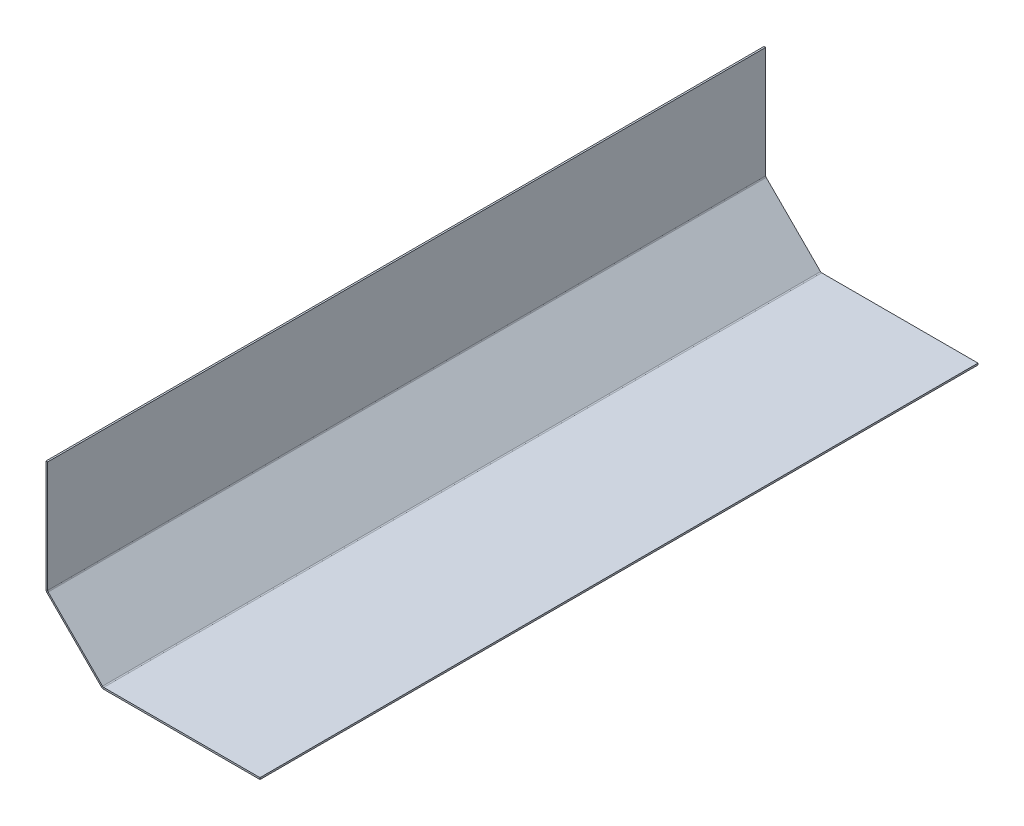
ISO-10303-21;
HEADER;
FILE_DESCRIPTION(('STEP AP214'),'2;1');
FILE_NAME('part.step','',(''),(''),'','','');
FILE_SCHEMA(('AUTOMOTIVE_DESIGN { 1 0 10303 214 1 1 1 1 }'));
ENDSEC;
DATA;
#1=APPLICATION_CONTEXT('core data for automotive mechanical design processes');
#2=APPLICATION_PROTOCOL_DEFINITION('international standard','automotive_design',2000,#1);
#3=PRODUCT_CONTEXT('',#1,'mechanical');
#4=PRODUCT('Part','Part','',(#3));
#5=PRODUCT_RELATED_PRODUCT_CATEGORY('part','',(#4));
#6=PRODUCT_DEFINITION_FORMATION('','',#4);
#7=PRODUCT_DEFINITION_CONTEXT('part definition',#1,'design');
#8=PRODUCT_DEFINITION('design','',#6,#7);
#9=PRODUCT_DEFINITION_SHAPE('','',#8);
#10=(LENGTH_UNIT() NAMED_UNIT(*) SI_UNIT(.MILLI.,.METRE.));
#11=(NAMED_UNIT(*) PLANE_ANGLE_UNIT() SI_UNIT($,.RADIAN.));
#12=(NAMED_UNIT(*) SI_UNIT($,.STERADIAN.) SOLID_ANGLE_UNIT());
#13=UNCERTAINTY_MEASURE_WITH_UNIT(LENGTH_MEASURE(1.E-05),#10,'distance_accuracy_value','');
#14=(GEOMETRIC_REPRESENTATION_CONTEXT(3) GLOBAL_UNCERTAINTY_ASSIGNED_CONTEXT((#13)) GLOBAL_UNIT_ASSIGNED_CONTEXT((#10,
#11,#12)) REPRESENTATION_CONTEXT('',''));
#15=CARTESIAN_POINT('',(0.,0.,0.));
#16=DIRECTION('',(0.,0.,1.));
#17=DIRECTION('',(1.,0.,0.));
#18=AXIS2_PLACEMENT_3D('',#15,#16,#17);
#19=CARTESIAN_POINT('',(3.51471862576144,-403.514718625761,-2550.));
#20=DIRECTION('',(0.,0.,-1.));
#21=DIRECTION('',(-1.,0.,0.));
#22=AXIS2_PLACEMENT_3D('',#19,#20,#21);
#23=PLANE('',#22);
#24=DIRECTION('',(0.70710678118655,0.707106781186545,0.));
#25=VECTOR('',#24,1.);
#26=CARTESIAN_POINT('',(3.51471862576144,-403.514718625761,-2550.));
#27=LINE('',#26,#25);
#28=CARTESIAN_POINT('',(3.51471862576144,-403.514718625761,-2550.));
#29=VERTEX_POINT('',#28);
#30=CARTESIAN_POINT('',(7.75735931288074,-399.272077938642,-2550.));
#31=VERTEX_POINT('',#30);
#32=EDGE_CURVE('E11',#29,#31,#27,.T.);
#33=ORIENTED_EDGE('',*,*,#32,.F.);
#34=CARTESIAN_POINT('',(12.,-395.029437251523,-2550.));
#35=DIRECTION('',(0.,0.,-1.));
#36=DIRECTION('',(-1.,0.,0.));
#37=AXIS2_PLACEMENT_3D('',#34,#35,#36);
#38=CIRCLE('',#37,12.);
#39=CARTESIAN_POINT('',(0.,-395.029437251523,-2550.));
#40=VERTEX_POINT('',#39);
#41=EDGE_CURVE('E140',#40,#29,#38,.F.);
#42=ORIENTED_EDGE('',*,*,#41,.F.);
#43=DIRECTION('',(-1.,0.,0.));
#44=VECTOR('',#43,1.);
#45=CARTESIAN_POINT('',(6.00000000000003,-395.029437251523,-2550.));
#46=LINE('',#45,#44);
#47=CARTESIAN_POINT('',(6.00000000000003,-395.029437251523,-2550.));
#48=VERTEX_POINT('',#47);
#49=EDGE_CURVE('E47',#48,#40,#46,.T.);
#50=ORIENTED_EDGE('',*,*,#49,.F.);
#51=CARTESIAN_POINT('',(12.,-395.029437251523,-2550.));
#52=DIRECTION('',(0.,0.,1.));
#53=DIRECTION('',(1.,0.,0.));
#54=AXIS2_PLACEMENT_3D('',#51,#52,#53);
#55=CIRCLE('',#54,6.);
#56=EDGE_CURVE('E143',#48,#31,#55,.T.);
#57=ORIENTED_EDGE('',*,*,#56,.T.);
#58=EDGE_LOOP('',(#33,#42,#50,#57));
#59=FACE_BOUND('',#58,.T.);
#60=ADVANCED_FACE('F39',(#59),#23,.T.);
#61=CARTESIAN_POINT('',(6.00000000000003,-395.029437251523,-2550.));
#62=DIRECTION('',(0.,0.,-1.));
#63=DIRECTION('',(-1.,0.,0.));
#64=AXIS2_PLACEMENT_3D('',#61,#62,#63);
#65=PLANE('',#64);
#66=DIRECTION('',(0.707106781186546,-0.707106781186549,0.));
#67=VECTOR('',#66,1.);
#68=CARTESIAN_POINT('',(0.,-400.,-2550.));
#69=LINE('',#68,#67);
#70=CARTESIAN_POINT('',(196.485281374238,-596.485281374239,-2550.));
#71=VERTEX_POINT('',#70);
#72=EDGE_CURVE('E154',#29,#71,#69,.T.);
#73=ORIENTED_EDGE('',*,*,#72,.F.);
#74=ORIENTED_EDGE('',*,*,#32,.T.);
#75=DIRECTION('',(0.707106781186546,-0.707106781186549,0.));
#76=VECTOR('',#75,1.);
#77=CARTESIAN_POINT('',(4.24264068711934,-395.757359312881,-2550.));
#78=LINE('',#77,#76);
#79=CARTESIAN_POINT('',(200.727922061357,-592.242640687119,-2550.));
#80=VERTEX_POINT('',#79);
#81=EDGE_CURVE('E259',#31,#80,#78,.T.);
#82=ORIENTED_EDGE('',*,*,#81,.T.);
#83=DIRECTION('',(-0.707106781186545,-0.70710678118655,0.));
#84=VECTOR('',#83,1.);
#85=CARTESIAN_POINT('',(200.727922061357,-592.242640687119,-2550.));
#86=LINE('',#85,#84);
#87=EDGE_CURVE('E164',#80,#71,#86,.T.);
#88=ORIENTED_EDGE('',*,*,#87,.T.);
#89=EDGE_LOOP('',(#73,#74,#82,#88));
#90=FACE_BOUND('',#89,.T.);
#91=ADVANCED_FACE('F163',(#90),#65,.T.);
#92=CARTESIAN_POINT('',(0.,-395.029437251523,0.));
#93=DIRECTION('',(0.,0.,1.));
#94=DIRECTION('',(1.,0.,0.));
#95=AXIS2_PLACEMENT_3D('',#92,#93,#94);
#96=PLANE('',#95);
#97=DIRECTION('',(1.,0.,0.));
#98=VECTOR('',#97,1.);
#99=CARTESIAN_POINT('',(0.,-395.029437251523,0.));
#100=LINE('',#99,#98);
#101=CARTESIAN_POINT('',(0.,-395.029437251523,0.));
#102=VERTEX_POINT('',#101);
#103=CARTESIAN_POINT('',(6.00000000000003,-395.029437251523,0.));
#104=VERTEX_POINT('',#103);
#105=EDGE_CURVE('E241',#102,#104,#100,.T.);
#106=ORIENTED_EDGE('',*,*,#105,.F.);
#107=CARTESIAN_POINT('',(12.,-395.029437251523,0.));
#108=DIRECTION('',(0.,0.,-1.));
#109=DIRECTION('',(-1.,0.,0.));
#110=AXIS2_PLACEMENT_3D('',#107,#108,#109);
#111=CIRCLE('',#110,12.);
#112=CARTESIAN_POINT('',(3.51471862576144,-403.514718625761,0.));
#113=VERTEX_POINT('',#112);
#114=EDGE_CURVE('E204',#102,#113,#111,.F.);
#115=ORIENTED_EDGE('',*,*,#114,.T.);
#116=DIRECTION('',(-0.70710678118655,-0.707106781186545,0.));
#117=VECTOR('',#116,1.);
#118=CARTESIAN_POINT('',(7.75735931288074,-399.272077938642,0.));
#119=LINE('',#118,#117);
#120=CARTESIAN_POINT('',(7.75735931288074,-399.272077938642,0.));
#121=VERTEX_POINT('',#120);
#122=EDGE_CURVE('E239',#121,#113,#119,.T.);
#123=ORIENTED_EDGE('',*,*,#122,.F.);
#124=CARTESIAN_POINT('',(12.,-395.029437251523,0.));
#125=DIRECTION('',(0.,0.,1.));
#126=DIRECTION('',(1.,0.,0.));
#127=AXIS2_PLACEMENT_3D('',#124,#125,#126);
#128=CIRCLE('',#127,6.);
#129=EDGE_CURVE('E193',#104,#121,#128,.T.);
#130=ORIENTED_EDGE('',*,*,#129,.F.);
#131=EDGE_LOOP('',(#106,#115,#123,#130));
#132=FACE_BOUND('',#131,.T.);
#133=ADVANCED_FACE('F308',(#132),#96,.T.);
#134=CARTESIAN_POINT('',(7.75735931288074,-399.272077938642,0.));
#135=DIRECTION('',(0.,0.,1.));
#136=DIRECTION('',(1.,0.,0.));
#137=AXIS2_PLACEMENT_3D('',#134,#135,#136);
#138=PLANE('',#137);
#139=DIRECTION('',(0.,-1.,0.));
#140=VECTOR('',#139,1.);
#141=CARTESIAN_POINT('',(0.,0.,0.));
#142=LINE('',#141,#140);
#143=CARTESIAN_POINT('',(0.,0.,0.));
#144=VERTEX_POINT('',#143);
#145=EDGE_CURVE('E201',#144,#102,#142,.T.);
#146=ORIENTED_EDGE('',*,*,#145,.T.);
#147=ORIENTED_EDGE('',*,*,#105,.T.);
#148=DIRECTION('',(0.,-1.,0.));
#149=VECTOR('',#148,1.);
#150=CARTESIAN_POINT('',(6.,0.,0.));
#151=LINE('',#150,#149);
#152=CARTESIAN_POINT('',(6.,0.,0.));
#153=VERTEX_POINT('',#152);
#154=EDGE_CURVE('E196',#153,#104,#151,.T.);
#155=ORIENTED_EDGE('',*,*,#154,.F.);
#156=DIRECTION('',(1.,0.,0.));
#157=VECTOR('',#156,1.);
#158=CARTESIAN_POINT('',(0.,0.,0.));
#159=LINE('',#158,#157);
#160=EDGE_CURVE('E199',#144,#153,#159,.T.);
#161=ORIENTED_EDGE('',*,*,#160,.F.);
#162=EDGE_LOOP('',(#146,#147,#155,#161));
#163=FACE_BOUND('',#162,.T.);
#164=ADVANCED_FACE('F312',(#163),#138,.T.);
#165=CARTESIAN_POINT('',(204.970562748477,-600.,-2550.));
#166=DIRECTION('',(0.,0.,-1.));
#167=DIRECTION('',(-1.,0.,0.));
#168=AXIS2_PLACEMENT_3D('',#165,#166,#167);
#169=PLANE('',#168);
#170=DIRECTION('',(0.,1.,0.));
#171=VECTOR('',#170,1.);
#172=CARTESIAN_POINT('',(204.970562748477,-600.,-2550.));
#173=LINE('',#172,#171);
#174=CARTESIAN_POINT('',(204.970562748477,-600.,-2550.));
#175=VERTEX_POINT('',#174);
#176=CARTESIAN_POINT('',(204.970562748477,-594.,-2550.));
#177=VERTEX_POINT('',#176);
#178=EDGE_CURVE('E55',#175,#177,#173,.T.);
#179=ORIENTED_EDGE('',*,*,#178,.F.);
#180=CARTESIAN_POINT('',(204.970562748477,-588.,-2550.));
#181=DIRECTION('',(0.,0.,-1.));
#182=DIRECTION('',(-1.,0.,0.));
#183=AXIS2_PLACEMENT_3D('',#180,#181,#182);
#184=CIRCLE('',#183,12.);
#185=EDGE_CURVE('E166',#71,#175,#184,.F.);
#186=ORIENTED_EDGE('',*,*,#185,.F.);
#187=ORIENTED_EDGE('',*,*,#87,.F.);
#188=CARTESIAN_POINT('',(204.970562748477,-588.,-2550.));
#189=DIRECTION('',(0.,0.,1.));
#190=DIRECTION('',(1.,0.,0.));
#191=AXIS2_PLACEMENT_3D('',#188,#189,#190);
#192=CIRCLE('',#191,6.);
#193=EDGE_CURVE('E261',#80,#177,#192,.T.);
#194=ORIENTED_EDGE('',*,*,#193,.T.);
#195=EDGE_LOOP('',(#179,#186,#187,#194));
#196=FACE_BOUND('',#195,.T.);
#197=ADVANCED_FACE('F276',(#196),#169,.T.);
#198=CARTESIAN_POINT('',(200.727922061357,-592.242640687119,-2550.));
#199=DIRECTION('',(0.,0.,-1.));
#200=DIRECTION('',(-1.,0.,0.));
#201=AXIS2_PLACEMENT_3D('',#198,#199,#200);
#202=PLANE('',#201);
#203=DIRECTION('',(1.,0.,0.));
#204=VECTOR('',#203,1.);
#205=CARTESIAN_POINT('',(199.999999999999,-600.,-2550.));
#206=LINE('',#205,#204);
#207=CARTESIAN_POINT('',(759.999999999999,-600.,-2550.));
#208=VERTEX_POINT('',#207);
#209=EDGE_CURVE('E209',#175,#208,#206,.T.);
#210=ORIENTED_EDGE('',*,*,#209,.F.);
#211=ORIENTED_EDGE('',*,*,#178,.T.);
#212=DIRECTION('',(1.,0.,0.));
#213=VECTOR('',#212,1.);
#214=CARTESIAN_POINT('',(199.999999999999,-594.,-2550.));
#215=LINE('',#214,#213);
#216=CARTESIAN_POINT('',(760.,-594.,-2550.));
#217=VERTEX_POINT('',#216);
#218=EDGE_CURVE('E265',#177,#217,#215,.T.);
#219=ORIENTED_EDGE('',*,*,#218,.T.);
#220=DIRECTION('',(0.,-1.,0.));
#221=VECTOR('',#220,1.);
#222=CARTESIAN_POINT('',(760.,-594.,-2550.));
#223=LINE('',#222,#221);
#224=EDGE_CURVE('E112',#217,#208,#223,.T.);
#225=ORIENTED_EDGE('',*,*,#224,.T.);
#226=EDGE_LOOP('',(#210,#211,#219,#225));
#227=FACE_BOUND('',#226,.T.);
#228=ADVANCED_FACE('F272',(#227),#202,.T.);
#229=CARTESIAN_POINT('',(196.485281374238,-596.485281374239,0.));
#230=DIRECTION('',(0.,0.,1.));
#231=DIRECTION('',(1.,0.,0.));
#232=AXIS2_PLACEMENT_3D('',#229,#230,#231);
#233=PLANE('',#232);
#234=DIRECTION('',(0.707106781186545,0.70710678118655,0.));
#235=VECTOR('',#234,1.);
#236=CARTESIAN_POINT('',(196.485281374238,-596.485281374239,0.));
#237=LINE('',#236,#235);
#238=CARTESIAN_POINT('',(196.485281374238,-596.485281374239,0.));
#239=VERTEX_POINT('',#238);
#240=CARTESIAN_POINT('',(200.727922061357,-592.242640687119,0.));
#241=VERTEX_POINT('',#240);
#242=EDGE_CURVE('E96',#239,#241,#237,.T.);
#243=ORIENTED_EDGE('',*,*,#242,.F.);
#244=CARTESIAN_POINT('',(204.970562748477,-588.,0.));
#245=DIRECTION('',(0.,0.,-1.));
#246=DIRECTION('',(-1.,0.,0.));
#247=AXIS2_PLACEMENT_3D('',#244,#245,#246);
#248=CIRCLE('',#247,12.);
#249=CARTESIAN_POINT('',(204.970562748477,-600.,0.));
#250=VERTEX_POINT('',#249);
#251=EDGE_CURVE('E207',#239,#250,#248,.F.);
#252=ORIENTED_EDGE('',*,*,#251,.T.);
#253=DIRECTION('',(0.,-1.,0.));
#254=VECTOR('',#253,1.);
#255=CARTESIAN_POINT('',(204.970562748477,-594.,0.));
#256=LINE('',#255,#254);
#257=CARTESIAN_POINT('',(204.970562748477,-594.,0.));
#258=VERTEX_POINT('',#257);
#259=EDGE_CURVE('E103',#258,#250,#256,.T.);
#260=ORIENTED_EDGE('',*,*,#259,.F.);
#261=CARTESIAN_POINT('',(204.970562748477,-588.,0.));
#262=DIRECTION('',(0.,0.,1.));
#263=DIRECTION('',(1.,0.,0.));
#264=AXIS2_PLACEMENT_3D('',#261,#262,#263);
#265=CIRCLE('',#264,6.);
#266=EDGE_CURVE('E187',#241,#258,#265,.T.);
#267=ORIENTED_EDGE('',*,*,#266,.F.);
#268=EDGE_LOOP('',(#243,#252,#260,#267));
#269=FACE_BOUND('',#268,.T.);
#270=ADVANCED_FACE('F293',(#269),#233,.T.);
#271=CARTESIAN_POINT('',(204.970562748477,-594.,0.));
#272=DIRECTION('',(0.,0.,1.));
#273=DIRECTION('',(1.,0.,0.));
#274=AXIS2_PLACEMENT_3D('',#271,#272,#273);
#275=PLANE('',#274);
#276=DIRECTION('',(0.707106781186546,-0.707106781186549,0.));
#277=VECTOR('',#276,1.);
#278=CARTESIAN_POINT('',(0.,-400.,0.));
#279=LINE('',#278,#277);
#280=EDGE_CURVE('E156',#113,#239,#279,.T.);
#281=ORIENTED_EDGE('',*,*,#280,.T.);
#282=ORIENTED_EDGE('',*,*,#242,.T.);
#283=DIRECTION('',(0.707106781186546,-0.707106781186549,0.));
#284=VECTOR('',#283,1.);
#285=CARTESIAN_POINT('',(4.24264068711934,-395.757359312881,0.));
#286=LINE('',#285,#284);
#287=EDGE_CURVE('E190',#121,#241,#286,.T.);
#288=ORIENTED_EDGE('',*,*,#287,.F.);
#289=ORIENTED_EDGE('',*,*,#122,.T.);
#290=EDGE_LOOP('',(#281,#282,#288,#289));
#291=FACE_BOUND('',#290,.T.);
#292=ADVANCED_FACE('F295',(#291),#275,.T.);
#293=CARTESIAN_POINT('',(199.999999999999,-600.,-2550.));
#294=DIRECTION('',(0.,-1.,0.));
#295=DIRECTION('',(0.,0.,-1.));
#296=AXIS2_PLACEMENT_3D('',#293,#294,#295);
#297=PLANE('',#296);
#298=DIRECTION('',(1.,0.,0.));
#299=VECTOR('',#298,1.);
#300=CARTESIAN_POINT('',(199.999999999999,-600.,0.));
#301=LINE('',#300,#299);
#302=CARTESIAN_POINT('',(759.999999999999,-600.,0.));
#303=VERTEX_POINT('',#302);
#304=EDGE_CURVE('E180',#250,#303,#301,.T.);
#305=ORIENTED_EDGE('',*,*,#304,.F.);
#306=DIRECTION('',(0.,0.,1.));
#307=VECTOR('',#306,1.);
#308=CARTESIAN_POINT('',(204.970562748477,-600.,-2550.));
#309=LINE('',#308,#307);
#310=EDGE_CURVE('E210',#175,#250,#309,.T.);
#311=ORIENTED_EDGE('',*,*,#310,.F.);
#312=ORIENTED_EDGE('',*,*,#209,.T.);
#313=DIRECTION('',(0.,0.,1.));
#314=VECTOR('',#313,1.);
#315=CARTESIAN_POINT('',(759.999999999999,-600.,-2550.));
#316=LINE('',#315,#314);
#317=EDGE_CURVE('E179',#208,#303,#316,.T.);
#318=ORIENTED_EDGE('',*,*,#317,.T.);
#319=EDGE_LOOP('',(#305,#311,#312,#318));
#320=FACE_BOUND('',#319,.T.);
#321=ADVANCED_FACE('F271',(#320),#297,.T.);
#322=CARTESIAN_POINT('',(204.970562748477,-588.,-2550.));
#323=DIRECTION('',(0.,0.,1.));
#324=DIRECTION('',(1.,0.,0.));
#325=AXIS2_PLACEMENT_3D('',#322,#323,#324);
#326=CYLINDRICAL_SURFACE('',#325,12.);
#327=ORIENTED_EDGE('',*,*,#251,.F.);
#328=DIRECTION('',(0.,0.,1.));
#329=VECTOR('',#328,1.);
#330=CARTESIAN_POINT('',(196.485281374238,-596.485281374239,-2550.));
#331=LINE('',#330,#329);
#332=EDGE_CURVE('E160',#71,#239,#331,.T.);
#333=ORIENTED_EDGE('',*,*,#332,.F.);
#334=ORIENTED_EDGE('',*,*,#185,.T.);
#335=ORIENTED_EDGE('',*,*,#310,.T.);
#336=EDGE_LOOP('',(#327,#333,#334,#335));
#337=FACE_BOUND('',#336,.T.);
#338=ADVANCED_FACE('F275',(#337),#326,.T.);
#339=CARTESIAN_POINT('',(0.,-400.,-2550.));
#340=DIRECTION('',(-0.707106781186549,-0.707106781186547,0.));
#341=DIRECTION('',(0.707106781186546,-0.707106781186549,0.));
#342=AXIS2_PLACEMENT_3D('',#339,#340,#341);
#343=PLANE('',#342);
#344=ORIENTED_EDGE('',*,*,#280,.F.);
#345=DIRECTION('',(0.,0.,1.));
#346=VECTOR('',#345,1.);
#347=CARTESIAN_POINT('',(3.51471862576144,-403.514718625761,-2550.));
#348=LINE('',#347,#346);
#349=EDGE_CURVE('E152',#29,#113,#348,.T.);
#350=ORIENTED_EDGE('',*,*,#349,.F.);
#351=ORIENTED_EDGE('',*,*,#72,.T.);
#352=ORIENTED_EDGE('',*,*,#332,.T.);
#353=EDGE_LOOP('',(#344,#350,#351,#352));
#354=FACE_BOUND('',#353,.T.);
#355=ADVANCED_FACE('F153',(#354),#343,.T.);
#356=CARTESIAN_POINT('',(12.,-395.029437251523,-2550.));
#357=DIRECTION('',(0.,0.,1.));
#358=DIRECTION('',(1.,0.,0.));
#359=AXIS2_PLACEMENT_3D('',#356,#357,#358);
#360=CYLINDRICAL_SURFACE('',#359,12.);
#361=ORIENTED_EDGE('',*,*,#114,.F.);
#362=DIRECTION('',(0.,0.,1.));
#363=VECTOR('',#362,1.);
#364=CARTESIAN_POINT('',(0.,-395.029437251523,-2550.));
#365=LINE('',#364,#363);
#366=EDGE_CURVE('E161',#40,#102,#365,.T.);
#367=ORIENTED_EDGE('',*,*,#366,.F.);
#368=ORIENTED_EDGE('',*,*,#41,.T.);
#369=ORIENTED_EDGE('',*,*,#349,.T.);
#370=EDGE_LOOP('',(#361,#367,#368,#369));
#371=FACE_BOUND('',#370,.T.);
#372=ADVANCED_FACE('F169',(#371),#360,.T.);
#373=CARTESIAN_POINT('',(0.,0.,-2550.));
#374=DIRECTION('',(-1.,0.,0.));
#375=DIRECTION('',(0.,-1.,0.));
#376=AXIS2_PLACEMENT_3D('',#373,#374,#375);
#377=PLANE('',#376);
#378=ORIENTED_EDGE('',*,*,#145,.F.);
#379=DIRECTION('',(0.,0.,1.));
#380=VECTOR('',#379,1.);
#381=CARTESIAN_POINT('',(0.,0.,-2550.));
#382=LINE('',#381,#380);
#383=CARTESIAN_POINT('',(0.,0.,-2550.));
#384=VERTEX_POINT('',#383);
#385=EDGE_CURVE('E214',#384,#144,#382,.T.);
#386=ORIENTED_EDGE('',*,*,#385,.F.);
#387=DIRECTION('',(0.,-1.,0.));
#388=VECTOR('',#387,1.);
#389=CARTESIAN_POINT('',(0.,0.,-2550.));
#390=LINE('',#389,#388);
#391=EDGE_CURVE('E171',#384,#40,#390,.T.);
#392=ORIENTED_EDGE('',*,*,#391,.T.);
#393=ORIENTED_EDGE('',*,*,#366,.T.);
#394=EDGE_LOOP('',(#378,#386,#392,#393));
#395=FACE_BOUND('',#394,.T.);
#396=ADVANCED_FACE('F377',(#395),#377,.T.);
#397=CARTESIAN_POINT('',(0.,0.,-2550.));
#398=DIRECTION('',(0.,-1.,0.));
#399=DIRECTION('',(1.,0.,0.));
#400=AXIS2_PLACEMENT_3D('',#397,#398,#399);
#401=PLANE('',#400);
#402=ORIENTED_EDGE('',*,*,#160,.T.);
#403=DIRECTION('',(0.,0.,1.));
#404=VECTOR('',#403,1.);
#405=CARTESIAN_POINT('',(6.,0.,-2550.));
#406=LINE('',#405,#404);
#407=CARTESIAN_POINT('',(6.,0.,-2550.));
#408=VERTEX_POINT('',#407);
#409=EDGE_CURVE('E216',#408,#153,#406,.T.);
#410=ORIENTED_EDGE('',*,*,#409,.F.);
#411=DIRECTION('',(1.,0.,0.));
#412=VECTOR('',#411,1.);
#413=CARTESIAN_POINT('',(0.,0.,-2550.));
#414=LINE('',#413,#412);
#415=EDGE_CURVE('E173',#384,#408,#414,.T.);
#416=ORIENTED_EDGE('',*,*,#415,.F.);
#417=ORIENTED_EDGE('',*,*,#385,.T.);
#418=EDGE_LOOP('',(#402,#410,#416,#417));
#419=FACE_BOUND('',#418,.T.);
#420=ADVANCED_FACE('F387',(#419),#401,.F.);
#421=CARTESIAN_POINT('',(6.,0.,-2550.));
#422=DIRECTION('',(-1.,0.,0.));
#423=DIRECTION('',(0.,-1.,0.));
#424=AXIS2_PLACEMENT_3D('',#421,#422,#423);
#425=PLANE('',#424);
#426=ORIENTED_EDGE('',*,*,#154,.T.);
#427=DIRECTION('',(0.,0.,1.));
#428=VECTOR('',#427,1.);
#429=CARTESIAN_POINT('',(6.00000000000003,-395.029437251523,-2550.));
#430=LINE('',#429,#428);
#431=EDGE_CURVE('E219',#48,#104,#430,.T.);
#432=ORIENTED_EDGE('',*,*,#431,.F.);
#433=DIRECTION('',(0.,-1.,0.));
#434=VECTOR('',#433,1.);
#435=CARTESIAN_POINT('',(6.,0.,-2550.));
#436=LINE('',#435,#434);
#437=EDGE_CURVE('E247',#408,#48,#436,.T.);
#438=ORIENTED_EDGE('',*,*,#437,.F.);
#439=ORIENTED_EDGE('',*,*,#409,.T.);
#440=EDGE_LOOP('',(#426,#432,#438,#439));
#441=FACE_BOUND('',#440,.T.);
#442=ADVANCED_FACE('F253',(#441),#425,.F.);
#443=CARTESIAN_POINT('',(12.,-395.029437251523,-2550.));
#444=DIRECTION('',(0.,0.,1.));
#445=DIRECTION('',(1.,0.,0.));
#446=AXIS2_PLACEMENT_3D('',#443,#444,#445);
#447=CYLINDRICAL_SURFACE('',#446,6.);
#448=ORIENTED_EDGE('',*,*,#129,.T.);
#449=DIRECTION('',(0.,0.,1.));
#450=VECTOR('',#449,1.);
#451=CARTESIAN_POINT('',(7.75735931288074,-399.272077938642,-2550.));
#452=LINE('',#451,#450);
#453=EDGE_CURVE('E222',#31,#121,#452,.T.);
#454=ORIENTED_EDGE('',*,*,#453,.F.);
#455=ORIENTED_EDGE('',*,*,#56,.F.);
#456=ORIENTED_EDGE('',*,*,#431,.T.);
#457=EDGE_LOOP('',(#448,#454,#455,#456));
#458=FACE_BOUND('',#457,.T.);
#459=ADVANCED_FACE('F257',(#458),#447,.F.);
#460=CARTESIAN_POINT('',(4.24264068711934,-395.757359312881,-2550.));
#461=DIRECTION('',(-0.707106781186549,-0.707106781186547,0.));
#462=DIRECTION('',(0.707106781186546,-0.707106781186549,0.));
#463=AXIS2_PLACEMENT_3D('',#460,#461,#462);
#464=PLANE('',#463);
#465=ORIENTED_EDGE('',*,*,#287,.T.);
#466=DIRECTION('',(0.,0.,1.));
#467=VECTOR('',#466,1.);
#468=CARTESIAN_POINT('',(200.727922061357,-592.242640687119,-2550.));
#469=LINE('',#468,#467);
#470=EDGE_CURVE('E225',#80,#241,#469,.T.);
#471=ORIENTED_EDGE('',*,*,#470,.F.);
#472=ORIENTED_EDGE('',*,*,#81,.F.);
#473=ORIENTED_EDGE('',*,*,#453,.T.);
#474=EDGE_LOOP('',(#465,#471,#472,#473));
#475=FACE_BOUND('',#474,.T.);
#476=ADVANCED_FACE('F281',(#475),#464,.F.);
#477=CARTESIAN_POINT('',(204.970562748477,-588.,-2550.));
#478=DIRECTION('',(0.,0.,1.));
#479=DIRECTION('',(1.,0.,0.));
#480=AXIS2_PLACEMENT_3D('',#477,#478,#479);
#481=CYLINDRICAL_SURFACE('',#480,6.);
#482=ORIENTED_EDGE('',*,*,#266,.T.);
#483=DIRECTION('',(0.,0.,1.));
#484=VECTOR('',#483,1.);
#485=CARTESIAN_POINT('',(204.970562748477,-594.,-2550.));
#486=LINE('',#485,#484);
#487=EDGE_CURVE('E228',#177,#258,#486,.T.);
#488=ORIENTED_EDGE('',*,*,#487,.F.);
#489=ORIENTED_EDGE('',*,*,#193,.F.);
#490=ORIENTED_EDGE('',*,*,#470,.T.);
#491=EDGE_LOOP('',(#482,#488,#489,#490));
#492=FACE_BOUND('',#491,.T.);
#493=ADVANCED_FACE('F284',(#492),#481,.F.);
#494=CARTESIAN_POINT('',(199.999999999999,-594.,-2550.));
#495=DIRECTION('',(0.,-1.,0.));
#496=DIRECTION('',(0.,0.,-1.));
#497=AXIS2_PLACEMENT_3D('',#494,#495,#496);
#498=PLANE('',#497);
#499=DIRECTION('',(1.,0.,0.));
#500=VECTOR('',#499,1.);
#501=CARTESIAN_POINT('',(199.999999999999,-594.,0.));
#502=LINE('',#501,#500);
#503=CARTESIAN_POINT('',(760.,-594.,0.));
#504=VERTEX_POINT('',#503);
#505=EDGE_CURVE('E185',#258,#504,#502,.T.);
#506=ORIENTED_EDGE('',*,*,#505,.T.);
#507=DIRECTION('',(0.,0.,1.));
#508=VECTOR('',#507,1.);
#509=CARTESIAN_POINT('',(760.,-594.,-2550.));
#510=LINE('',#509,#508);
#511=EDGE_CURVE('E231',#217,#504,#510,.T.);
#512=ORIENTED_EDGE('',*,*,#511,.F.);
#513=ORIENTED_EDGE('',*,*,#218,.F.);
#514=ORIENTED_EDGE('',*,*,#487,.T.);
#515=EDGE_LOOP('',(#506,#512,#513,#514));
#516=FACE_BOUND('',#515,.T.);
#517=ADVANCED_FACE('F288',(#516),#498,.F.);
#518=CARTESIAN_POINT('',(760.,-594.,-2550.));
#519=DIRECTION('',(-1.,0.,0.));
#520=DIRECTION('',(0.,-1.,0.));
#521=AXIS2_PLACEMENT_3D('',#518,#519,#520);
#522=PLANE('',#521);
#523=DIRECTION('',(0.,-1.,0.));
#524=VECTOR('',#523,1.);
#525=CARTESIAN_POINT('',(760.,-594.,0.));
#526=LINE('',#525,#524);
#527=EDGE_CURVE('E182',#504,#303,#526,.T.);
#528=ORIENTED_EDGE('',*,*,#527,.T.);
#529=ORIENTED_EDGE('',*,*,#317,.F.);
#530=ORIENTED_EDGE('',*,*,#224,.F.);
#531=ORIENTED_EDGE('',*,*,#511,.T.);
#532=EDGE_LOOP('',(#528,#529,#530,#531));
#533=FACE_BOUND('',#532,.T.);
#534=ADVANCED_FACE('F291',(#533),#522,.F.);
#535=CARTESIAN_POINT('',(204.970562748477,-588.,-2550.));
#536=DIRECTION('',(0.,0.,1.));
#537=DIRECTION('',(1.,0.,0.));
#538=AXIS2_PLACEMENT_3D('',#535,#536,#537);
#539=PLANE('',#538);
#540=ORIENTED_EDGE('',*,*,#437,.T.);
#541=ORIENTED_EDGE('',*,*,#49,.T.);
#542=ORIENTED_EDGE('',*,*,#391,.F.);
#543=ORIENTED_EDGE('',*,*,#415,.T.);
#544=EDGE_LOOP('',(#540,#541,#542,#543));
#545=FACE_BOUND('',#544,.T.);
#546=ADVANCED_FACE('F245',(#545),#539,.F.);
#547=CARTESIAN_POINT('',(204.970562748477,-588.,0.));
#548=DIRECTION('',(0.,0.,1.));
#549=DIRECTION('',(1.,0.,0.));
#550=AXIS2_PLACEMENT_3D('',#547,#548,#549);
#551=PLANE('',#550);
#552=ORIENTED_EDGE('',*,*,#304,.T.);
#553=ORIENTED_EDGE('',*,*,#527,.F.);
#554=ORIENTED_EDGE('',*,*,#505,.F.);
#555=ORIENTED_EDGE('',*,*,#259,.T.);
#556=EDGE_LOOP('',(#552,#553,#554,#555));
#557=FACE_BOUND('',#556,.T.);
#558=ADVANCED_FACE('F292',(#557),#551,.T.);
#559=CLOSED_SHELL('',(#60,#91,#133,#164,#197,#228,#270,#292,#321,#338,#355,#372,#396,#420,#442,
#459,#476,#493,#517,#534,#546,#558));
#560=MANIFOLD_SOLID_BREP('B2',#559);
#561=ADVANCED_BREP_SHAPE_REPRESENTATION('',(#18,#560),#14);
#562=SHAPE_DEFINITION_REPRESENTATION(#9,#561);
ENDSEC;
END-ISO-10303-21;
